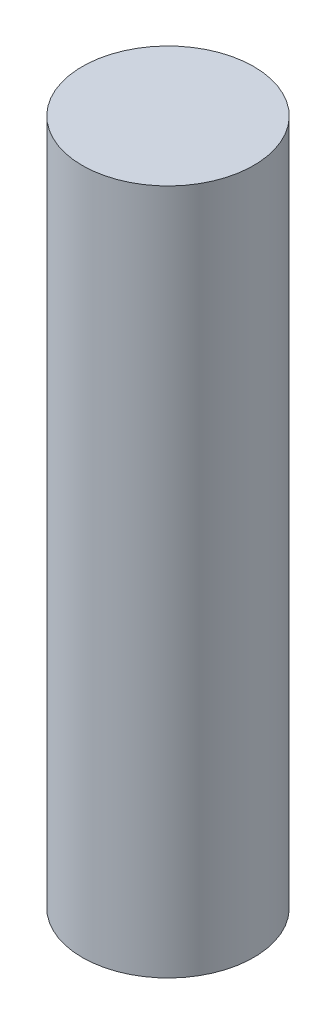
ISO-10303-21;
HEADER;
FILE_DESCRIPTION(('STEP AP214'),'2;1');
FILE_NAME('part.step','',(''),(''),'','','');
FILE_SCHEMA(('AUTOMOTIVE_DESIGN { 1 0 10303 214 1 1 1 1 }'));
ENDSEC;
DATA;
#1=APPLICATION_CONTEXT('core data for automotive mechanical design processes');
#2=APPLICATION_PROTOCOL_DEFINITION('international standard','automotive_design',2000,#1);
#3=PRODUCT_CONTEXT('',#1,'mechanical');
#4=PRODUCT('Part','Part','',(#3));
#5=PRODUCT_RELATED_PRODUCT_CATEGORY('part','',(#4));
#6=PRODUCT_DEFINITION_FORMATION('','',#4);
#7=PRODUCT_DEFINITION_CONTEXT('part definition',#1,'design');
#8=PRODUCT_DEFINITION('design','',#6,#7);
#9=PRODUCT_DEFINITION_SHAPE('','',#8);
#10=(LENGTH_UNIT() NAMED_UNIT(*) SI_UNIT(.MILLI.,.METRE.));
#11=(NAMED_UNIT(*) PLANE_ANGLE_UNIT() SI_UNIT($,.RADIAN.));
#12=(NAMED_UNIT(*) SI_UNIT($,.STERADIAN.) SOLID_ANGLE_UNIT());
#13=UNCERTAINTY_MEASURE_WITH_UNIT(LENGTH_MEASURE(1.E-05),#10,'distance_accuracy_value','');
#14=(GEOMETRIC_REPRESENTATION_CONTEXT(3) GLOBAL_UNCERTAINTY_ASSIGNED_CONTEXT((#13)) GLOBAL_UNIT_ASSIGNED_CONTEXT((#10,
#11,#12)) REPRESENTATION_CONTEXT('',''));
#15=CARTESIAN_POINT('',(0.,0.,0.));
#16=DIRECTION('',(0.,0.,1.));
#17=DIRECTION('',(1.,0.,0.));
#18=AXIS2_PLACEMENT_3D('',#15,#16,#17);
#19=CARTESIAN_POINT('',(-0.389434893795866,-5.34244167768412,-13.4799818499073));
#20=DIRECTION('',(0.,1.,0.));
#21=DIRECTION('',(0.,0.,1.));
#22=AXIS2_PLACEMENT_3D('',#19,#20,#21);
#23=CYLINDRICAL_SURFACE('',#22,1.25);
#24=CARTESIAN_POINT('',(-0.389434893795866,-5.34244167768412,-13.4799818499073));
#25=DIRECTION('',(0.,-1.,0.));
#26=DIRECTION('',(0.,0.,-1.));
#27=AXIS2_PLACEMENT_3D('',#24,#25,#26);
#28=CIRCLE('',#27,1.25);
#29=CARTESIAN_POINT('',(-0.389434893795866,-5.34244167768412,-14.7299818499073));
#30=VERTEX_POINT('',#29);
#31=EDGE_CURVE('E10',#30,#30,#28,.T.);
#32=ORIENTED_EDGE('',*,*,#31,.F.);
#33=EDGE_LOOP('',(#32));
#34=FACE_BOUND('',#33,.T.);
#35=CARTESIAN_POINT('',(-0.389434893795866,4.65755832231588,-13.4799818499073));
#36=DIRECTION('',(0.,-1.,0.));
#37=DIRECTION('',(0.,0.,-1.));
#38=AXIS2_PLACEMENT_3D('',#35,#36,#37);
#39=CIRCLE('',#38,1.25);
#40=CARTESIAN_POINT('',(-0.389434893795866,4.65755832231588,-14.7299818499073));
#41=VERTEX_POINT('',#40);
#42=EDGE_CURVE('E32',#41,#41,#39,.T.);
#43=ORIENTED_EDGE('',*,*,#42,.T.);
#44=EDGE_LOOP('',(#43));
#45=FACE_BOUND('',#44,.T.);
#46=ADVANCED_FACE('F29',(#34,#45),#23,.T.);
#47=CARTESIAN_POINT('',(-0.389434893795866,-5.34244167768412,-13.4799818499073));
#48=DIRECTION('',(0.,-1.,0.));
#49=DIRECTION('',(0.,0.,-1.));
#50=AXIS2_PLACEMENT_3D('',#47,#48,#49);
#51=PLANE('',#50);
#52=ORIENTED_EDGE('',*,*,#31,.T.);
#53=EDGE_LOOP('',(#52));
#54=FACE_BOUND('',#53,.T.);
#55=ADVANCED_FACE('F44',(#54),#51,.T.);
#56=CARTESIAN_POINT('',(-0.389434893795866,4.65755832231588,-13.4799818499073));
#57=DIRECTION('',(0.,-1.,0.));
#58=DIRECTION('',(0.,0.,-1.));
#59=AXIS2_PLACEMENT_3D('',#56,#57,#58);
#60=PLANE('',#59);
#61=ORIENTED_EDGE('',*,*,#42,.F.);
#62=EDGE_LOOP('',(#61));
#63=FACE_BOUND('',#62,.T.);
#64=ADVANCED_FACE('F42',(#63),#60,.F.);
#65=CLOSED_SHELL('',(#46,#55,#64));
#66=MANIFOLD_SOLID_BREP('B2',#65);
#67=ADVANCED_BREP_SHAPE_REPRESENTATION('',(#18,#66),#14);
#68=SHAPE_DEFINITION_REPRESENTATION(#9,#67);
ENDSEC;
END-ISO-10303-21;
